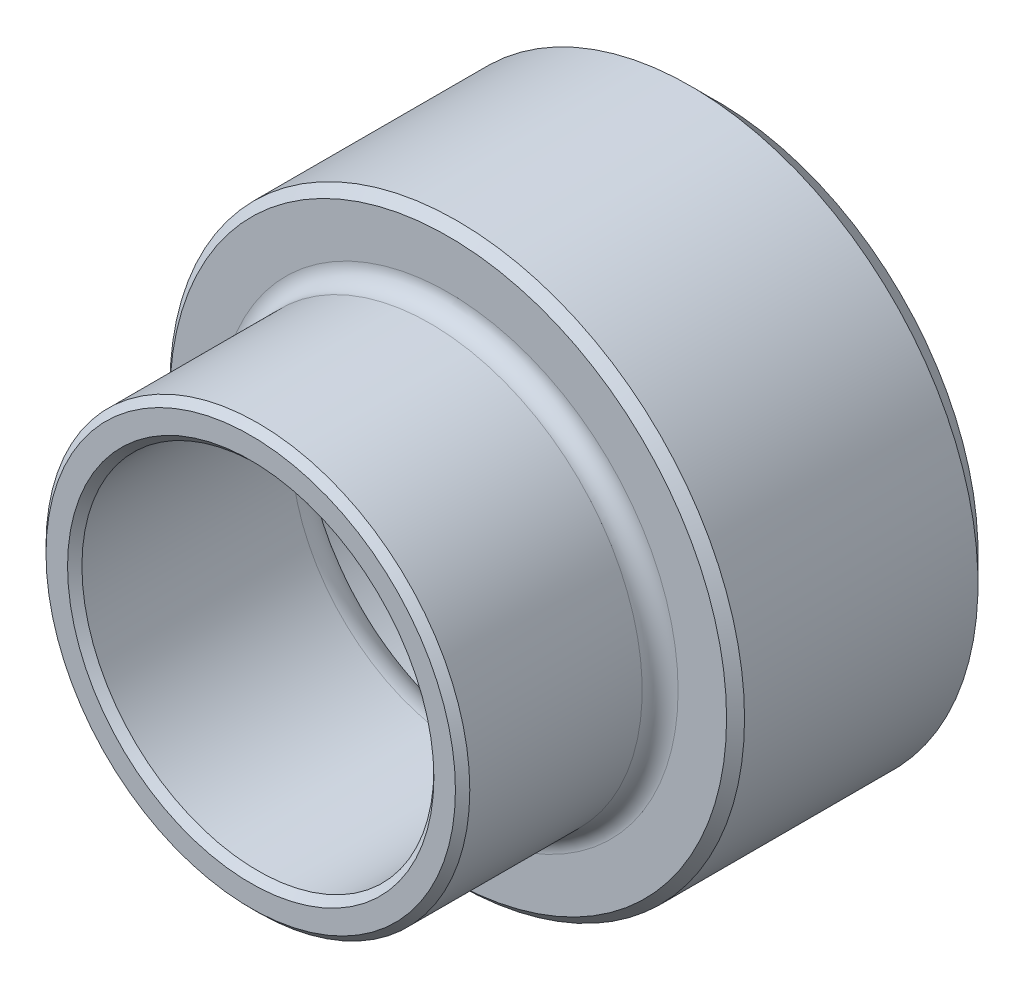
ISO-10303-21;
HEADER;
FILE_DESCRIPTION(('STEP AP214'),'2;1');
FILE_NAME('part.step','',(''),(''),'','','');
FILE_SCHEMA(('AUTOMOTIVE_DESIGN { 1 0 10303 214 1 1 1 1 }'));
ENDSEC;
DATA;
#1=APPLICATION_CONTEXT('core data for automotive mechanical design processes');
#2=APPLICATION_PROTOCOL_DEFINITION('international standard','automotive_design',2000,#1);
#3=PRODUCT_CONTEXT('',#1,'mechanical');
#4=PRODUCT('Part','Part','',(#3));
#5=PRODUCT_RELATED_PRODUCT_CATEGORY('part','',(#4));
#6=PRODUCT_DEFINITION_FORMATION('','',#4);
#7=PRODUCT_DEFINITION_CONTEXT('part definition',#1,'design');
#8=PRODUCT_DEFINITION('design','',#6,#7);
#9=PRODUCT_DEFINITION_SHAPE('','',#8);
#10=(LENGTH_UNIT() NAMED_UNIT(*) SI_UNIT(.MILLI.,.METRE.));
#11=(NAMED_UNIT(*) PLANE_ANGLE_UNIT() SI_UNIT($,.RADIAN.));
#12=(NAMED_UNIT(*) SI_UNIT($,.STERADIAN.) SOLID_ANGLE_UNIT());
#13=UNCERTAINTY_MEASURE_WITH_UNIT(LENGTH_MEASURE(1.E-05),#10,'distance_accuracy_value','');
#14=(GEOMETRIC_REPRESENTATION_CONTEXT(3) GLOBAL_UNCERTAINTY_ASSIGNED_CONTEXT((#13)) GLOBAL_UNIT_ASSIGNED_CONTEXT((#10,
#11,#12)) REPRESENTATION_CONTEXT('',''));
#15=CARTESIAN_POINT('',(0.,0.,0.));
#16=DIRECTION('',(0.,0.,1.));
#17=DIRECTION('',(1.,0.,0.));
#18=AXIS2_PLACEMENT_3D('',#15,#16,#17);
#19=CARTESIAN_POINT('',(0.,0.,13.));
#20=DIRECTION('',(0.,0.,-1.));
#21=DIRECTION('',(-1.,0.,0.));
#22=AXIS2_PLACEMENT_3D('',#19,#20,#21);
#23=CYLINDRICAL_SURFACE('',#22,5.9);
#24=CARTESIAN_POINT('',(0.,0.,12.8));
#25=DIRECTION('',(0.,0.,1.));
#26=DIRECTION('',(1.,0.,0.));
#27=AXIS2_PLACEMENT_3D('',#24,#25,#26);
#28=CIRCLE('',#27,5.9);
#29=CARTESIAN_POINT('',(5.9,0.,12.8));
#30=VERTEX_POINT('',#29);
#31=EDGE_CURVE('E55',#30,#30,#28,.F.);
#32=ORIENTED_EDGE('',*,*,#31,.T.);
#33=EDGE_LOOP('',(#32));
#34=FACE_BOUND('',#33,.T.);
#35=CARTESIAN_POINT('',(0.,0.,7.99999999998723));
#36=DIRECTION('',(0.,0.,-1.));
#37=DIRECTION('',(-1.,0.,0.));
#38=AXIS2_PLACEMENT_3D('',#35,#36,#37);
#39=CIRCLE('',#38,5.9);
#40=CARTESIAN_POINT('',(-5.9,0.,7.99999999998723));
#41=VERTEX_POINT('',#40);
#42=EDGE_CURVE('E76',#41,#41,#39,.T.);
#43=ORIENTED_EDGE('',*,*,#42,.F.);
#44=EDGE_LOOP('',(#43));
#45=FACE_BOUND('',#44,.T.);
#46=ADVANCED_FACE('F32',(#34,#45),#23,.T.);
#47=CARTESIAN_POINT('',(0.,0.,7.99999999998723));
#48=DIRECTION('',(0.,0.,-1.));
#49=DIRECTION('',(-1.,0.,0.));
#50=AXIS2_PLACEMENT_3D('',#47,#48,#49);
#51=TOROIDAL_SURFACE('',#50,6.4,0.5);
#52=ORIENTED_EDGE('',*,*,#42,.T.);
#53=EDGE_LOOP('',(#52));
#54=FACE_BOUND('',#53,.T.);
#55=CARTESIAN_POINT('',(0.,0.,7.49999999998723));
#56=DIRECTION('',(0.,0.,-1.));
#57=DIRECTION('',(-1.,0.,0.));
#58=AXIS2_PLACEMENT_3D('',#55,#56,#57);
#59=CIRCLE('',#58,6.4);
#60=CARTESIAN_POINT('',(-6.4,0.,7.49999999998723));
#61=VERTEX_POINT('',#60);
#62=EDGE_CURVE('E79',#61,#61,#59,.T.);
#63=ORIENTED_EDGE('',*,*,#62,.F.);
#64=EDGE_LOOP('',(#63));
#65=FACE_BOUND('',#64,.T.);
#66=ADVANCED_FACE('F103',(#54,#65),#51,.F.);
#67=CARTESIAN_POINT('',(8.00000000001278,0.,7.49999999998723));
#68=DIRECTION('',(0.,0.,1.));
#69=DIRECTION('',(1.,0.,0.));
#70=AXIS2_PLACEMENT_3D('',#67,#68,#69);
#71=PLANE('',#70);
#72=CARTESIAN_POINT('',(0.,0.,7.49999999998723));
#73=DIRECTION('',(0.,0.,1.));
#74=DIRECTION('',(1.,0.,0.));
#75=AXIS2_PLACEMENT_3D('',#72,#73,#74);
#76=CIRCLE('',#75,7.75000000001278);
#77=CARTESIAN_POINT('',(7.75000000001278,0.,7.49999999998723));
#78=VERTEX_POINT('',#77);
#79=EDGE_CURVE('E64',#78,#78,#76,.T.);
#80=ORIENTED_EDGE('',*,*,#79,.T.);
#81=EDGE_LOOP('',(#80));
#82=FACE_BOUND('',#81,.T.);
#83=ORIENTED_EDGE('',*,*,#62,.T.);
#84=EDGE_LOOP('',(#83));
#85=FACE_BOUND('',#84,.T.);
#86=ADVANCED_FACE('F109',(#82,#85),#71,.T.);
#87=CARTESIAN_POINT('',(0.,0.,13.));
#88=DIRECTION('',(0.,0.,-1.));
#89=DIRECTION('',(-1.,0.,0.));
#90=AXIS2_PLACEMENT_3D('',#87,#88,#89);
#91=CYLINDRICAL_SURFACE('',#90,8.00000000001278);
#92=CARTESIAN_POINT('',(0.,0.,7.24999999998722));
#93=DIRECTION('',(0.,0.,1.));
#94=DIRECTION('',(1.,0.,0.));
#95=AXIS2_PLACEMENT_3D('',#92,#93,#94);
#96=CIRCLE('',#95,8.00000000001278);
#97=CARTESIAN_POINT('',(8.00000000001278,0.,7.24999999998722));
#98=VERTEX_POINT('',#97);
#99=EDGE_CURVE('E67',#98,#98,#96,.F.);
#100=ORIENTED_EDGE('',*,*,#99,.T.);
#101=EDGE_LOOP('',(#100));
#102=FACE_BOUND('',#101,.T.);
#103=CARTESIAN_POINT('',(0.,0.,0.750000000000004));
#104=DIRECTION('',(0.,0.,-1.));
#105=DIRECTION('',(-1.,0.,0.));
#106=AXIS2_PLACEMENT_3D('',#103,#104,#105);
#107=CIRCLE('',#106,8.00000000001278);
#108=CARTESIAN_POINT('',(-8.00000000001278,0.,0.750000000000004));
#109=VERTEX_POINT('',#108);
#110=EDGE_CURVE('E70',#109,#109,#107,.F.);
#111=ORIENTED_EDGE('',*,*,#110,.T.);
#112=EDGE_LOOP('',(#111));
#113=FACE_BOUND('',#112,.T.);
#114=ADVANCED_FACE('F148',(#102,#113),#91,.T.);
#115=CARTESIAN_POINT('',(0.,0.,0.));
#116=DIRECTION('',(0.,0.,-1.));
#117=DIRECTION('',(-1.,0.,0.));
#118=AXIS2_PLACEMENT_3D('',#115,#116,#117);
#119=PLANE('',#118);
#120=CARTESIAN_POINT('',(0.,0.,0.));
#121=DIRECTION('',(0.,0.,-1.));
#122=DIRECTION('',(-1.,0.,0.));
#123=AXIS2_PLACEMENT_3D('',#120,#121,#122);
#124=CIRCLE('',#123,6.2);
#125=CARTESIAN_POINT('',(-6.2,0.,0.));
#126=VERTEX_POINT('',#125);
#127=EDGE_CURVE('E58',#126,#126,#124,.F.);
#128=ORIENTED_EDGE('',*,*,#127,.T.);
#129=EDGE_LOOP('',(#128));
#130=FACE_BOUND('',#129,.T.);
#131=CARTESIAN_POINT('',(0.,0.,0.));
#132=DIRECTION('',(0.,0.,-1.));
#133=DIRECTION('',(-1.,0.,0.));
#134=AXIS2_PLACEMENT_3D('',#131,#132,#133);
#135=CIRCLE('',#134,7.25000000001278);
#136=CARTESIAN_POINT('',(-7.25000000001278,0.,0.));
#137=VERTEX_POINT('',#136);
#138=EDGE_CURVE('E73',#137,#137,#135,.T.);
#139=ORIENTED_EDGE('',*,*,#138,.T.);
#140=EDGE_LOOP('',(#139));
#141=FACE_BOUND('',#140,.T.);
#142=ADVANCED_FACE('F143',(#130,#141),#119,.T.);
#143=CARTESIAN_POINT('',(0.,0.,13.));
#144=DIRECTION('',(0.,0.,-1.));
#145=DIRECTION('',(-1.,0.,0.));
#146=AXIS2_PLACEMENT_3D('',#143,#144,#145);
#147=CYLINDRICAL_SURFACE('',#146,4.9);
#148=CARTESIAN_POINT('',(0.,0.,6.97671945911809));
#149=DIRECTION('',(0.,0.,-1.));
#150=DIRECTION('',(-1.,0.,0.));
#151=AXIS2_PLACEMENT_3D('',#148,#149,#150);
#152=CIRCLE('',#151,4.9);
#153=CARTESIAN_POINT('',(-4.9,0.,6.97671945911809));
#154=VERTEX_POINT('',#153);
#155=EDGE_CURVE('E10',#154,#154,#152,.T.);
#156=ORIENTED_EDGE('',*,*,#155,.T.);
#157=EDGE_LOOP('',(#156));
#158=FACE_BOUND('',#157,.T.);
#159=CARTESIAN_POINT('',(0.,0.,12.8));
#160=DIRECTION('',(0.,0.,1.));
#161=DIRECTION('',(1.,0.,0.));
#162=AXIS2_PLACEMENT_3D('',#159,#160,#161);
#163=CIRCLE('',#162,4.9);
#164=CARTESIAN_POINT('',(4.9,0.,12.8));
#165=VERTEX_POINT('',#164);
#166=EDGE_CURVE('E43',#165,#165,#163,.T.);
#167=ORIENTED_EDGE('',*,*,#166,.T.);
#168=EDGE_LOOP('',(#167));
#169=FACE_BOUND('',#168,.T.);
#170=ADVANCED_FACE('F137',(#158,#169),#147,.F.);
#171=CARTESIAN_POINT('',(5.9,0.,13.));
#172=DIRECTION('',(0.,0.,1.));
#173=DIRECTION('',(1.,0.,0.));
#174=AXIS2_PLACEMENT_3D('',#171,#172,#173);
#175=PLANE('',#174);
#176=CARTESIAN_POINT('',(0.,0.,13.));
#177=DIRECTION('',(0.,0.,1.));
#178=DIRECTION('',(1.,0.,0.));
#179=AXIS2_PLACEMENT_3D('',#176,#177,#178);
#180=CIRCLE('',#179,5.70000000000001);
#181=CARTESIAN_POINT('',(5.70000000000001,0.,13.));
#182=VERTEX_POINT('',#181);
#183=EDGE_CURVE('E47',#182,#182,#180,.T.);
#184=ORIENTED_EDGE('',*,*,#183,.T.);
#185=EDGE_LOOP('',(#184));
#186=FACE_BOUND('',#185,.T.);
#187=CARTESIAN_POINT('',(0.,0.,13.));
#188=DIRECTION('',(0.,0.,1.));
#189=DIRECTION('',(1.,0.,0.));
#190=AXIS2_PLACEMENT_3D('',#187,#188,#189);
#191=CIRCLE('',#190,5.1);
#192=CARTESIAN_POINT('',(5.1,0.,13.));
#193=VERTEX_POINT('',#192);
#194=EDGE_CURVE('E52',#193,#193,#191,.F.);
#195=ORIENTED_EDGE('',*,*,#194,.T.);
#196=EDGE_LOOP('',(#195));
#197=FACE_BOUND('',#196,.T.);
#198=ADVANCED_FACE('F100',(#186,#197),#175,.T.);
#199=CARTESIAN_POINT('',(0.,0.,5.75));
#200=DIRECTION('',(0.,0.,-1.));
#201=DIRECTION('',(-1.,0.,0.));
#202=AXIS2_PLACEMENT_3D('',#199,#200,#201);
#203=CONICAL_SURFACE('',#202,6.,1.02974425867665);
#204=CARTESIAN_POINT('',(0.,0.,6.11955215841597));
#205=DIRECTION('',(0.,0.,-1.));
#206=DIRECTION('',(-1.,0.,0.));
#207=AXIS2_PLACEMENT_3D('',#204,#205,#206);
#208=CIRCLE('',#207,5.38496192508995);
#209=CARTESIAN_POINT('',(-5.38496192508995,0.,6.11955215841597));
#210=VERTEX_POINT('',#209);
#211=EDGE_CURVE('E39',#210,#210,#208,.F.);
#212=ORIENTED_EDGE('',*,*,#211,.T.);
#213=EDGE_LOOP('',(#212));
#214=FACE_BOUND('',#213,.T.);
#215=CARTESIAN_POINT('',(0.,0.,5.75));
#216=DIRECTION('',(0.,0.,-1.));
#217=DIRECTION('',(-1.,0.,0.));
#218=AXIS2_PLACEMENT_3D('',#215,#216,#217);
#219=CIRCLE('',#218,6.);
#220=CARTESIAN_POINT('',(-6.,0.,5.75));
#221=VERTEX_POINT('',#220);
#222=EDGE_CURVE('E82',#221,#221,#219,.T.);
#223=ORIENTED_EDGE('',*,*,#222,.T.);
#224=EDGE_LOOP('',(#223));
#225=FACE_BOUND('',#224,.T.);
#226=ADVANCED_FACE('F86',(#214,#225),#203,.F.);
#227=CARTESIAN_POINT('',(0.,0.,0.));
#228=DIRECTION('',(0.,0.,-1.));
#229=DIRECTION('',(-1.,0.,0.));
#230=AXIS2_PLACEMENT_3D('',#227,#228,#229);
#231=CYLINDRICAL_SURFACE('',#230,6.);
#232=CARTESIAN_POINT('',(0.,0.,0.2));
#233=DIRECTION('',(0.,0.,-1.));
#234=DIRECTION('',(-1.,0.,0.));
#235=AXIS2_PLACEMENT_3D('',#232,#233,#234);
#236=CIRCLE('',#235,6.);
#237=CARTESIAN_POINT('',(-6.,0.,0.2));
#238=VERTEX_POINT('',#237);
#239=EDGE_CURVE('E61',#238,#238,#236,.T.);
#240=ORIENTED_EDGE('',*,*,#239,.T.);
#241=EDGE_LOOP('',(#240));
#242=FACE_BOUND('',#241,.T.);
#243=ORIENTED_EDGE('',*,*,#222,.F.);
#244=EDGE_LOOP('',(#243));
#245=FACE_BOUND('',#244,.T.);
#246=ADVANCED_FACE('F88',(#242,#245),#231,.F.);
#247=CARTESIAN_POINT('',(0.,0.,0.));
#248=DIRECTION('',(0.,0.,1.));
#249=DIRECTION('',(1.,0.,0.));
#250=AXIS2_PLACEMENT_3D('',#247,#248,#249);
#251=CONICAL_SURFACE('',#250,7.25000000001278,0.785398163397446);
#252=ORIENTED_EDGE('',*,*,#110,.F.);
#253=EDGE_LOOP('',(#252));
#254=FACE_BOUND('',#253,.T.);
#255=ORIENTED_EDGE('',*,*,#138,.F.);
#256=EDGE_LOOP('',(#255));
#257=FACE_BOUND('',#256,.T.);
#258=ADVANCED_FACE('F90',(#254,#257),#251,.T.);
#259=CARTESIAN_POINT('',(0.,0.,7.24999999998722));
#260=DIRECTION('',(0.,0.,-1.));
#261=DIRECTION('',(-1.,0.,0.));
#262=AXIS2_PLACEMENT_3D('',#259,#260,#261);
#263=CONICAL_SURFACE('',#262,8.00000000001278,0.785398163397445);
#264=ORIENTED_EDGE('',*,*,#79,.F.);
#265=EDGE_LOOP('',(#264));
#266=FACE_BOUND('',#265,.T.);
#267=ORIENTED_EDGE('',*,*,#99,.F.);
#268=EDGE_LOOP('',(#267));
#269=FACE_BOUND('',#268,.T.);
#270=ADVANCED_FACE('F97',(#266,#269),#263,.T.);
#271=CARTESIAN_POINT('',(0.,0.,0.2));
#272=DIRECTION('',(0.,0.,-1.));
#273=DIRECTION('',(-1.,0.,0.));
#274=AXIS2_PLACEMENT_3D('',#271,#272,#273);
#275=CONICAL_SURFACE('',#274,6.,0.78539816339745);
#276=ORIENTED_EDGE('',*,*,#127,.F.);
#277=EDGE_LOOP('',(#276));
#278=FACE_BOUND('',#277,.T.);
#279=ORIENTED_EDGE('',*,*,#239,.F.);
#280=EDGE_LOOP('',(#279));
#281=FACE_BOUND('',#280,.T.);
#282=ADVANCED_FACE('F117',(#278,#281),#275,.F.);
#283=CARTESIAN_POINT('',(0.,0.,12.8));
#284=DIRECTION('',(0.,0.,-1.));
#285=DIRECTION('',(-1.,0.,0.));
#286=AXIS2_PLACEMENT_3D('',#283,#284,#285);
#287=CONICAL_SURFACE('',#286,5.9,0.785398163397442);
#288=ORIENTED_EDGE('',*,*,#183,.F.);
#289=EDGE_LOOP('',(#288));
#290=FACE_BOUND('',#289,.T.);
#291=ORIENTED_EDGE('',*,*,#31,.F.);
#292=EDGE_LOOP('',(#291));
#293=FACE_BOUND('',#292,.T.);
#294=ADVANCED_FACE('F121',(#290,#293),#287,.T.);
#295=CARTESIAN_POINT('',(0.,0.,13.));
#296=DIRECTION('',(0.,0.,1.));
#297=DIRECTION('',(1.,0.,0.));
#298=AXIS2_PLACEMENT_3D('',#295,#296,#297);
#299=CONICAL_SURFACE('',#298,5.1,0.785398163397444);
#300=ORIENTED_EDGE('',*,*,#166,.F.);
#301=EDGE_LOOP('',(#300));
#302=FACE_BOUND('',#301,.T.);
#303=ORIENTED_EDGE('',*,*,#194,.F.);
#304=EDGE_LOOP('',(#303));
#305=FACE_BOUND('',#304,.T.);
#306=ADVANCED_FACE('F124',(#302,#305),#299,.F.);
#307=CARTESIAN_POINT('',(0.,0.,6.97671945911809));
#308=DIRECTION('',(0.,0.,-1.));
#309=DIRECTION('',(-1.,0.,0.));
#310=AXIS2_PLACEMENT_3D('',#307,#308,#309);
#311=TOROIDAL_SURFACE('',#310,5.9,1.);
#312=ORIENTED_EDGE('',*,*,#155,.F.);
#313=EDGE_LOOP('',(#312));
#314=FACE_BOUND('',#313,.T.);
#315=ORIENTED_EDGE('',*,*,#211,.F.);
#316=EDGE_LOOP('',(#315));
#317=FACE_BOUND('',#316,.T.);
#318=ADVANCED_FACE('F34',(#314,#317),#311,.T.);
#319=CLOSED_SHELL('',(#46,#66,#86,#114,#142,#170,#198,#226,#246,#258,#270,#282,#294,#306,#318));
#320=MANIFOLD_SOLID_BREP('B2',#319);
#321=ADVANCED_BREP_SHAPE_REPRESENTATION('',(#18,#320),#14);
#322=SHAPE_DEFINITION_REPRESENTATION(#9,#321);
ENDSEC;
END-ISO-10303-21;
